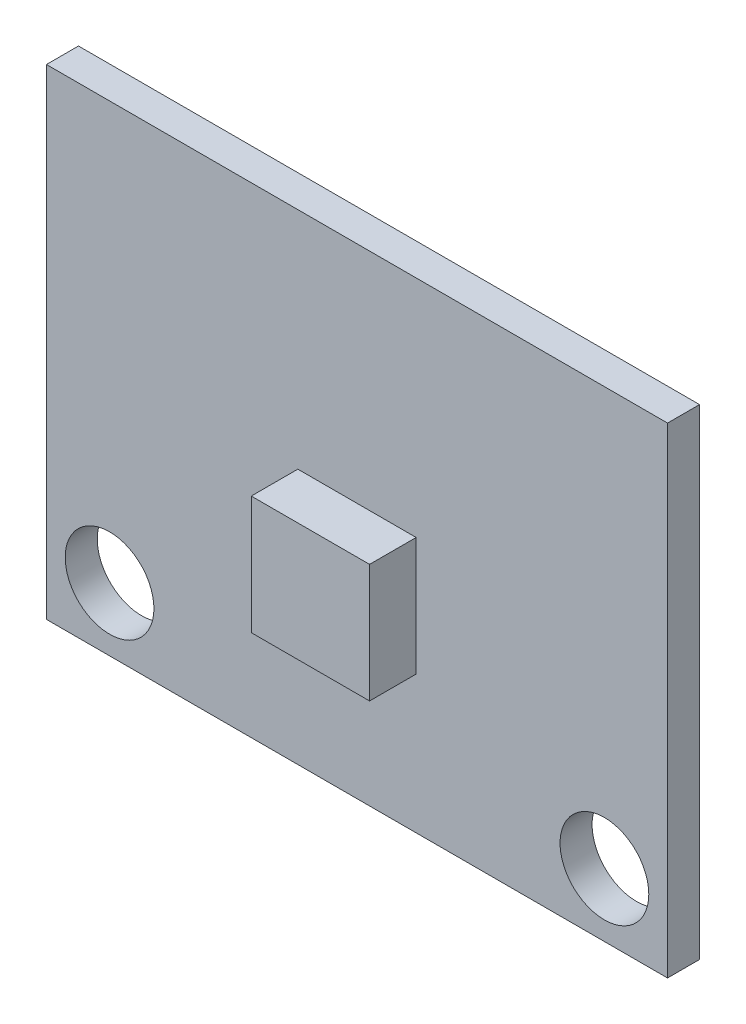
ISO-10303-21;
HEADER;
FILE_DESCRIPTION(('STEP AP214'),'2;1');
FILE_NAME('part.step','',(''),(''),'','','');
FILE_SCHEMA(('AUTOMOTIVE_DESIGN { 1 0 10303 214 1 1 1 1 }'));
ENDSEC;
DATA;
#1=APPLICATION_CONTEXT('core data for automotive mechanical design processes');
#2=APPLICATION_PROTOCOL_DEFINITION('international standard','automotive_design',2000,#1);
#3=PRODUCT_CONTEXT('',#1,'mechanical');
#4=PRODUCT('Part','Part','',(#3));
#5=PRODUCT_RELATED_PRODUCT_CATEGORY('part','',(#4));
#6=PRODUCT_DEFINITION_FORMATION('','',#4);
#7=PRODUCT_DEFINITION_CONTEXT('part definition',#1,'design');
#8=PRODUCT_DEFINITION('design','',#6,#7);
#9=PRODUCT_DEFINITION_SHAPE('','',#8);
#10=(LENGTH_UNIT() NAMED_UNIT(*) SI_UNIT(.MILLI.,.METRE.));
#11=(NAMED_UNIT(*) PLANE_ANGLE_UNIT() SI_UNIT($,.RADIAN.));
#12=(NAMED_UNIT(*) SI_UNIT($,.STERADIAN.) SOLID_ANGLE_UNIT());
#13=UNCERTAINTY_MEASURE_WITH_UNIT(LENGTH_MEASURE(1.E-05),#10,'distance_accuracy_value','');
#14=(GEOMETRIC_REPRESENTATION_CONTEXT(3) GLOBAL_UNCERTAINTY_ASSIGNED_CONTEXT((#13)) GLOBAL_UNIT_ASSIGNED_CONTEXT((#10,
#11,#12)) REPRESENTATION_CONTEXT('',''));
#15=CARTESIAN_POINT('',(0.,0.,0.));
#16=DIRECTION('',(0.,0.,1.));
#17=DIRECTION('',(1.,0.,0.));
#18=AXIS2_PLACEMENT_3D('',#15,#16,#17);
#19=CARTESIAN_POINT('',(0.,0.,2.7));
#20=DIRECTION('',(1.,0.,0.));
#21=DIRECTION('',(0.,1.,0.));
#22=AXIS2_PLACEMENT_3D('',#19,#20,#21);
#23=PLANE('',#22);
#24=DIRECTION('',(0.,-1.,0.));
#25=VECTOR('',#24,1.);
#26=CARTESIAN_POINT('',(0.,0.,1.0998));
#27=LINE('',#26,#25);
#28=CARTESIAN_POINT('',(0.,16.51,1.0998));
#29=VERTEX_POINT('',#28);
#30=CARTESIAN_POINT('',(0.,0.,1.0998));
#31=VERTEX_POINT('',#30);
#32=EDGE_CURVE('E146',#29,#31,#27,.T.);
#33=ORIENTED_EDGE('',*,*,#32,.F.);
#34=DIRECTION('',(0.,0.,-1.));
#35=VECTOR('',#34,1.);
#36=CARTESIAN_POINT('',(0.,16.51,2.7));
#37=LINE('',#36,#35);
#38=CARTESIAN_POINT('',(0.,16.51,0.));
#39=VERTEX_POINT('',#38);
#40=EDGE_CURVE('E166',#29,#39,#37,.T.);
#41=ORIENTED_EDGE('',*,*,#40,.T.);
#42=DIRECTION('',(0.,-1.,0.));
#43=VECTOR('',#42,1.);
#44=CARTESIAN_POINT('',(0.,0.,0.));
#45=LINE('',#44,#43);
#46=CARTESIAN_POINT('',(0.,0.,0.));
#47=VERTEX_POINT('',#46);
#48=EDGE_CURVE('E154',#39,#47,#45,.T.);
#49=ORIENTED_EDGE('',*,*,#48,.T.);
#50=DIRECTION('',(0.,0.,-1.));
#51=VECTOR('',#50,1.);
#52=CARTESIAN_POINT('',(0.,0.,2.7));
#53=LINE('',#52,#51);
#54=EDGE_CURVE('E12',#31,#47,#53,.T.);
#55=ORIENTED_EDGE('',*,*,#54,.F.);
#56=EDGE_LOOP('',(#33,#41,#49,#55));
#57=FACE_BOUND('',#56,.T.);
#58=ADVANCED_FACE('F33',(#57),#23,.F.);
#59=CARTESIAN_POINT('',(0.,0.,2.7));
#60=DIRECTION('',(0.,1.,0.));
#61=DIRECTION('',(0.,0.,1.));
#62=AXIS2_PLACEMENT_3D('',#59,#60,#61);
#63=PLANE('',#62);
#64=DIRECTION('',(1.,0.,0.));
#65=VECTOR('',#64,1.);
#66=CARTESIAN_POINT('',(0.,0.,1.0998));
#67=LINE('',#66,#65);
#68=CARTESIAN_POINT('',(21.336,0.,1.0998));
#69=VERTEX_POINT('',#68);
#70=EDGE_CURVE('E144',#31,#69,#67,.T.);
#71=ORIENTED_EDGE('',*,*,#70,.F.);
#72=ORIENTED_EDGE('',*,*,#54,.T.);
#73=DIRECTION('',(1.,0.,0.));
#74=VECTOR('',#73,1.);
#75=CARTESIAN_POINT('',(0.,0.,0.));
#76=LINE('',#75,#74);
#77=CARTESIAN_POINT('',(21.336,0.,0.));
#78=VERTEX_POINT('',#77);
#79=EDGE_CURVE('E157',#47,#78,#76,.T.);
#80=ORIENTED_EDGE('',*,*,#79,.T.);
#81=DIRECTION('',(0.,0.,-1.));
#82=VECTOR('',#81,1.);
#83=CARTESIAN_POINT('',(21.336,0.,2.7));
#84=LINE('',#83,#82);
#85=EDGE_CURVE('E41',#69,#78,#84,.T.);
#86=ORIENTED_EDGE('',*,*,#85,.F.);
#87=EDGE_LOOP('',(#71,#72,#80,#86));
#88=FACE_BOUND('',#87,.T.);
#89=ADVANCED_FACE('F179',(#88),#63,.F.);
#90=CARTESIAN_POINT('',(21.336,0.,2.7));
#91=DIRECTION('',(-1.,0.,0.));
#92=DIRECTION('',(0.,-1.,0.));
#93=AXIS2_PLACEMENT_3D('',#90,#91,#92);
#94=PLANE('',#93);
#95=DIRECTION('',(0.,1.,0.));
#96=VECTOR('',#95,1.);
#97=CARTESIAN_POINT('',(21.336,0.,1.0998));
#98=LINE('',#97,#96);
#99=CARTESIAN_POINT('',(21.336,16.51,1.0998));
#100=VERTEX_POINT('',#99);
#101=EDGE_CURVE('E56',#69,#100,#98,.T.);
#102=ORIENTED_EDGE('',*,*,#101,.F.);
#103=ORIENTED_EDGE('',*,*,#85,.T.);
#104=DIRECTION('',(0.,1.,0.));
#105=VECTOR('',#104,1.);
#106=CARTESIAN_POINT('',(21.336,0.,0.));
#107=LINE('',#106,#105);
#108=CARTESIAN_POINT('',(21.336,16.51,0.));
#109=VERTEX_POINT('',#108);
#110=EDGE_CURVE('E160',#78,#109,#107,.T.);
#111=ORIENTED_EDGE('',*,*,#110,.T.);
#112=DIRECTION('',(0.,0.,-1.));
#113=VECTOR('',#112,1.);
#114=CARTESIAN_POINT('',(21.336,16.51,2.7));
#115=LINE('',#114,#113);
#116=EDGE_CURVE('E168',#100,#109,#115,.T.);
#117=ORIENTED_EDGE('',*,*,#116,.F.);
#118=EDGE_LOOP('',(#102,#103,#111,#117));
#119=FACE_BOUND('',#118,.T.);
#120=ADVANCED_FACE('F172',(#119),#94,.F.);
#121=CARTESIAN_POINT('',(0.,16.51,2.7));
#122=DIRECTION('',(0.,-1.,0.));
#123=DIRECTION('',(0.,0.,-1.));
#124=AXIS2_PLACEMENT_3D('',#121,#122,#123);
#125=PLANE('',#124);
#126=DIRECTION('',(-1.,0.,0.));
#127=VECTOR('',#126,1.);
#128=CARTESIAN_POINT('',(0.,16.51,1.0998));
#129=LINE('',#128,#127);
#130=EDGE_CURVE('E141',#100,#29,#129,.T.);
#131=ORIENTED_EDGE('',*,*,#130,.F.);
#132=ORIENTED_EDGE('',*,*,#116,.T.);
#133=DIRECTION('',(-1.,0.,0.));
#134=VECTOR('',#133,1.);
#135=CARTESIAN_POINT('',(0.,16.51,0.));
#136=LINE('',#135,#134);
#137=EDGE_CURVE('E163',#109,#39,#136,.T.);
#138=ORIENTED_EDGE('',*,*,#137,.T.);
#139=ORIENTED_EDGE('',*,*,#40,.F.);
#140=EDGE_LOOP('',(#131,#132,#138,#139));
#141=FACE_BOUND('',#140,.T.);
#142=ADVANCED_FACE('F187',(#141),#125,.F.);
#143=CARTESIAN_POINT('',(2.168,2.168,2.7));
#144=DIRECTION('',(0.,0.,-1.));
#145=DIRECTION('',(-1.,0.,0.));
#146=AXIS2_PLACEMENT_3D('',#143,#144,#145);
#147=CYLINDRICAL_SURFACE('',#146,1.524);
#148=CARTESIAN_POINT('',(2.168,2.168,0.));
#149=DIRECTION('',(0.,0.,1.));
#150=DIRECTION('',(1.,0.,0.));
#151=AXIS2_PLACEMENT_3D('',#148,#149,#150);
#152=CIRCLE('',#151,1.524);
#153=CARTESIAN_POINT('',(3.692,2.168,0.));
#154=VERTEX_POINT('',#153);
#155=EDGE_CURVE('E151',#154,#154,#152,.T.);
#156=ORIENTED_EDGE('',*,*,#155,.F.);
#157=EDGE_LOOP('',(#156));
#158=FACE_BOUND('',#157,.T.);
#159=CARTESIAN_POINT('',(2.168,2.168,1.0998));
#160=DIRECTION('',(0.,0.,1.));
#161=DIRECTION('',(1.,0.,0.));
#162=AXIS2_PLACEMENT_3D('',#159,#160,#161);
#163=CIRCLE('',#162,1.524);
#164=CARTESIAN_POINT('',(3.692,2.168,1.0998));
#165=VERTEX_POINT('',#164);
#166=EDGE_CURVE('E138',#165,#165,#163,.T.);
#167=ORIENTED_EDGE('',*,*,#166,.T.);
#168=EDGE_LOOP('',(#167));
#169=FACE_BOUND('',#168,.T.);
#170=ADVANCED_FACE('F201',(#158,#169),#147,.F.);
#171=CARTESIAN_POINT('',(19.168,2.168,2.7));
#172=DIRECTION('',(0.,0.,-1.));
#173=DIRECTION('',(-1.,0.,0.));
#174=AXIS2_PLACEMENT_3D('',#171,#172,#173);
#175=CYLINDRICAL_SURFACE('',#174,1.524);
#176=CARTESIAN_POINT('',(19.168,2.168,0.));
#177=DIRECTION('',(0.,0.,1.));
#178=DIRECTION('',(1.,0.,0.));
#179=AXIS2_PLACEMENT_3D('',#176,#177,#178);
#180=CIRCLE('',#179,1.524);
#181=CARTESIAN_POINT('',(20.692,2.168,0.));
#182=VERTEX_POINT('',#181);
#183=EDGE_CURVE('E148',#182,#182,#180,.T.);
#184=ORIENTED_EDGE('',*,*,#183,.F.);
#185=EDGE_LOOP('',(#184));
#186=FACE_BOUND('',#185,.T.);
#187=CARTESIAN_POINT('',(19.168,2.168,1.0998));
#188=DIRECTION('',(0.,0.,1.));
#189=DIRECTION('',(1.,0.,0.));
#190=AXIS2_PLACEMENT_3D('',#187,#188,#189);
#191=CIRCLE('',#190,1.524);
#192=CARTESIAN_POINT('',(20.692,2.168,1.0998));
#193=VERTEX_POINT('',#192);
#194=EDGE_CURVE('E36',#193,#193,#191,.T.);
#195=ORIENTED_EDGE('',*,*,#194,.T.);
#196=EDGE_LOOP('',(#195));
#197=FACE_BOUND('',#196,.T.);
#198=ADVANCED_FACE('F204',(#186,#197),#175,.F.);
#199=CARTESIAN_POINT('',(0.,16.51,0.));
#200=DIRECTION('',(0.,0.,-1.));
#201=DIRECTION('',(-1.,0.,0.));
#202=AXIS2_PLACEMENT_3D('',#199,#200,#201);
#203=PLANE('',#202);
#204=ORIENTED_EDGE('',*,*,#155,.T.);
#205=EDGE_LOOP('',(#204));
#206=FACE_BOUND('',#205,.T.);
#207=ORIENTED_EDGE('',*,*,#48,.F.);
#208=ORIENTED_EDGE('',*,*,#137,.F.);
#209=ORIENTED_EDGE('',*,*,#110,.F.);
#210=ORIENTED_EDGE('',*,*,#79,.F.);
#211=EDGE_LOOP('',(#207,#208,#209,#210));
#212=FACE_BOUND('',#211,.T.);
#213=ORIENTED_EDGE('',*,*,#183,.T.);
#214=EDGE_LOOP('',(#213));
#215=FACE_BOUND('',#214,.T.);
#216=ADVANCED_FACE('F183',(#206,#212,#215),#203,.T.);
#217=CARTESIAN_POINT('',(10.668,8.255,1.0998));
#218=DIRECTION('',(0.,0.,1.));
#219=DIRECTION('',(1.,0.,0.));
#220=AXIS2_PLACEMENT_3D('',#217,#218,#219);
#221=PLANE('',#220);
#222=DIRECTION('',(-1.,0.,0.));
#223=VECTOR('',#222,1.);
#224=CARTESIAN_POINT('',(8.63599999999999,8.7884,1.0998));
#225=LINE('',#224,#223);
#226=CARTESIAN_POINT('',(12.7,8.7884,1.0998));
#227=VERTEX_POINT('',#226);
#228=CARTESIAN_POINT('',(8.63599999999999,8.7884,1.0998));
#229=VERTEX_POINT('',#228);
#230=EDGE_CURVE('E109',#227,#229,#225,.T.);
#231=ORIENTED_EDGE('',*,*,#230,.F.);
#232=DIRECTION('',(0.,1.,0.));
#233=VECTOR('',#232,1.);
#234=CARTESIAN_POINT('',(12.7,8.7884,1.0998));
#235=LINE('',#234,#233);
#236=CARTESIAN_POINT('',(12.7,4.7244,1.0998));
#237=VERTEX_POINT('',#236);
#238=EDGE_CURVE('E119',#237,#227,#235,.T.);
#239=ORIENTED_EDGE('',*,*,#238,.F.);
#240=DIRECTION('',(1.,0.,0.));
#241=VECTOR('',#240,1.);
#242=CARTESIAN_POINT('',(8.63599999999999,4.7244,1.0998));
#243=LINE('',#242,#241);
#244=CARTESIAN_POINT('',(8.63599999999999,4.7244,1.0998));
#245=VERTEX_POINT('',#244);
#246=EDGE_CURVE('E101',#245,#237,#243,.T.);
#247=ORIENTED_EDGE('',*,*,#246,.F.);
#248=DIRECTION('',(0.,-1.,0.));
#249=VECTOR('',#248,1.);
#250=CARTESIAN_POINT('',(8.63599999999999,8.7884,1.0998));
#251=LINE('',#250,#249);
#252=EDGE_CURVE('E116',#229,#245,#251,.T.);
#253=ORIENTED_EDGE('',*,*,#252,.F.);
#254=EDGE_LOOP('',(#231,#239,#247,#253));
#255=FACE_BOUND('',#254,.T.);
#256=ORIENTED_EDGE('',*,*,#194,.F.);
#257=EDGE_LOOP('',(#256));
#258=FACE_BOUND('',#257,.T.);
#259=ORIENTED_EDGE('',*,*,#166,.F.);
#260=EDGE_LOOP('',(#259));
#261=FACE_BOUND('',#260,.T.);
#262=ORIENTED_EDGE('',*,*,#32,.T.);
#263=ORIENTED_EDGE('',*,*,#70,.T.);
#264=ORIENTED_EDGE('',*,*,#101,.T.);
#265=ORIENTED_EDGE('',*,*,#130,.T.);
#266=EDGE_LOOP('',(#262,#263,#264,#265));
#267=FACE_BOUND('',#266,.T.);
#268=ADVANCED_FACE('F114',(#255,#258,#261,#267),#221,.T.);
#269=CARTESIAN_POINT('',(8.63599999999999,8.7884,1.0998));
#270=DIRECTION('',(-1.,0.,0.));
#271=DIRECTION('',(0.,0.,1.));
#272=AXIS2_PLACEMENT_3D('',#269,#270,#271);
#273=PLANE('',#272);
#274=DIRECTION('',(0.,-1.,0.));
#275=VECTOR('',#274,1.);
#276=CARTESIAN_POINT('',(8.63599999999999,8.7884,2.7));
#277=LINE('',#276,#275);
#278=CARTESIAN_POINT('',(8.63599999999999,8.7884,2.7));
#279=VERTEX_POINT('',#278);
#280=CARTESIAN_POINT('',(8.63599999999999,4.7244,2.7));
#281=VERTEX_POINT('',#280);
#282=EDGE_CURVE('E130',#279,#281,#277,.T.);
#283=ORIENTED_EDGE('',*,*,#282,.F.);
#284=DIRECTION('',(0.,0.,1.));
#285=VECTOR('',#284,1.);
#286=CARTESIAN_POINT('',(8.63599999999999,8.7884,1.0998));
#287=LINE('',#286,#285);
#288=EDGE_CURVE('E122',#229,#279,#287,.T.);
#289=ORIENTED_EDGE('',*,*,#288,.F.);
#290=ORIENTED_EDGE('',*,*,#252,.T.);
#291=DIRECTION('',(0.,0.,1.));
#292=VECTOR('',#291,1.);
#293=CARTESIAN_POINT('',(8.63599999999999,4.7244,1.0998));
#294=LINE('',#293,#292);
#295=EDGE_CURVE('E98',#245,#281,#294,.T.);
#296=ORIENTED_EDGE('',*,*,#295,.T.);
#297=EDGE_LOOP('',(#283,#289,#290,#296));
#298=FACE_BOUND('',#297,.T.);
#299=ADVANCED_FACE('F121',(#298),#273,.T.);
#300=CARTESIAN_POINT('',(8.63599999999999,8.7884,1.0998));
#301=DIRECTION('',(0.,1.,0.));
#302=DIRECTION('',(-1.,0.,0.));
#303=AXIS2_PLACEMENT_3D('',#300,#301,#302);
#304=PLANE('',#303);
#305=DIRECTION('',(-1.,0.,0.));
#306=VECTOR('',#305,1.);
#307=CARTESIAN_POINT('',(8.63599999999999,8.7884,2.7));
#308=LINE('',#307,#306);
#309=CARTESIAN_POINT('',(12.7,8.7884,2.7));
#310=VERTEX_POINT('',#309);
#311=EDGE_CURVE('E123',#310,#279,#308,.T.);
#312=ORIENTED_EDGE('',*,*,#311,.F.);
#313=DIRECTION('',(0.,0.,1.));
#314=VECTOR('',#313,1.);
#315=CARTESIAN_POINT('',(12.7,8.7884,1.0998));
#316=LINE('',#315,#314);
#317=EDGE_CURVE('E135',#227,#310,#316,.T.);
#318=ORIENTED_EDGE('',*,*,#317,.F.);
#319=ORIENTED_EDGE('',*,*,#230,.T.);
#320=ORIENTED_EDGE('',*,*,#288,.T.);
#321=EDGE_LOOP('',(#312,#318,#319,#320));
#322=FACE_BOUND('',#321,.T.);
#323=ADVANCED_FACE('F220',(#322),#304,.T.);
#324=CARTESIAN_POINT('',(12.7,8.7884,1.0998));
#325=DIRECTION('',(1.,0.,0.));
#326=DIRECTION('',(0.,1.,0.));
#327=AXIS2_PLACEMENT_3D('',#324,#325,#326);
#328=PLANE('',#327);
#329=DIRECTION('',(0.,1.,0.));
#330=VECTOR('',#329,1.);
#331=CARTESIAN_POINT('',(12.7,8.7884,2.7));
#332=LINE('',#331,#330);
#333=CARTESIAN_POINT('',(12.7,4.7244,2.7));
#334=VERTEX_POINT('',#333);
#335=EDGE_CURVE('E48',#334,#310,#332,.T.);
#336=ORIENTED_EDGE('',*,*,#335,.F.);
#337=DIRECTION('',(0.,0.,1.));
#338=VECTOR('',#337,1.);
#339=CARTESIAN_POINT('',(12.7,4.7244,1.0998));
#340=LINE('',#339,#338);
#341=EDGE_CURVE('E108',#237,#334,#340,.T.);
#342=ORIENTED_EDGE('',*,*,#341,.F.);
#343=ORIENTED_EDGE('',*,*,#238,.T.);
#344=ORIENTED_EDGE('',*,*,#317,.T.);
#345=EDGE_LOOP('',(#336,#342,#343,#344));
#346=FACE_BOUND('',#345,.T.);
#347=ADVANCED_FACE('F223',(#346),#328,.T.);
#348=CARTESIAN_POINT('',(8.63599999999999,4.7244,1.0998));
#349=DIRECTION('',(0.,-1.,0.));
#350=DIRECTION('',(0.,0.,-1.));
#351=AXIS2_PLACEMENT_3D('',#348,#349,#350);
#352=PLANE('',#351);
#353=DIRECTION('',(1.,0.,0.));
#354=VECTOR('',#353,1.);
#355=CARTESIAN_POINT('',(8.63599999999999,4.7244,2.7));
#356=LINE('',#355,#354);
#357=EDGE_CURVE('E103',#281,#334,#356,.T.);
#358=ORIENTED_EDGE('',*,*,#357,.F.);
#359=ORIENTED_EDGE('',*,*,#295,.F.);
#360=ORIENTED_EDGE('',*,*,#246,.T.);
#361=ORIENTED_EDGE('',*,*,#341,.T.);
#362=EDGE_LOOP('',(#358,#359,#360,#361));
#363=FACE_BOUND('',#362,.T.);
#364=ADVANCED_FACE('F100',(#363),#352,.T.);
#365=CARTESIAN_POINT('',(0.,16.51,2.7));
#366=DIRECTION('',(0.,0.,-1.));
#367=DIRECTION('',(-1.,0.,0.));
#368=AXIS2_PLACEMENT_3D('',#365,#366,#367);
#369=PLANE('',#368);
#370=ORIENTED_EDGE('',*,*,#282,.T.);
#371=ORIENTED_EDGE('',*,*,#357,.T.);
#372=ORIENTED_EDGE('',*,*,#335,.T.);
#373=ORIENTED_EDGE('',*,*,#311,.T.);
#374=EDGE_LOOP('',(#370,#371,#372,#373));
#375=FACE_BOUND('',#374,.T.);
#376=ADVANCED_FACE('F206',(#375),#369,.F.);
#377=CLOSED_SHELL('',(#58,#89,#120,#142,#170,#198,#216,#268,#299,#323,#347,#364,#376));
#378=MANIFOLD_SOLID_BREP('B2',#377);
#379=ADVANCED_BREP_SHAPE_REPRESENTATION('',(#18,#378),#14);
#380=SHAPE_DEFINITION_REPRESENTATION(#9,#379);
ENDSEC;
END-ISO-10303-21;
